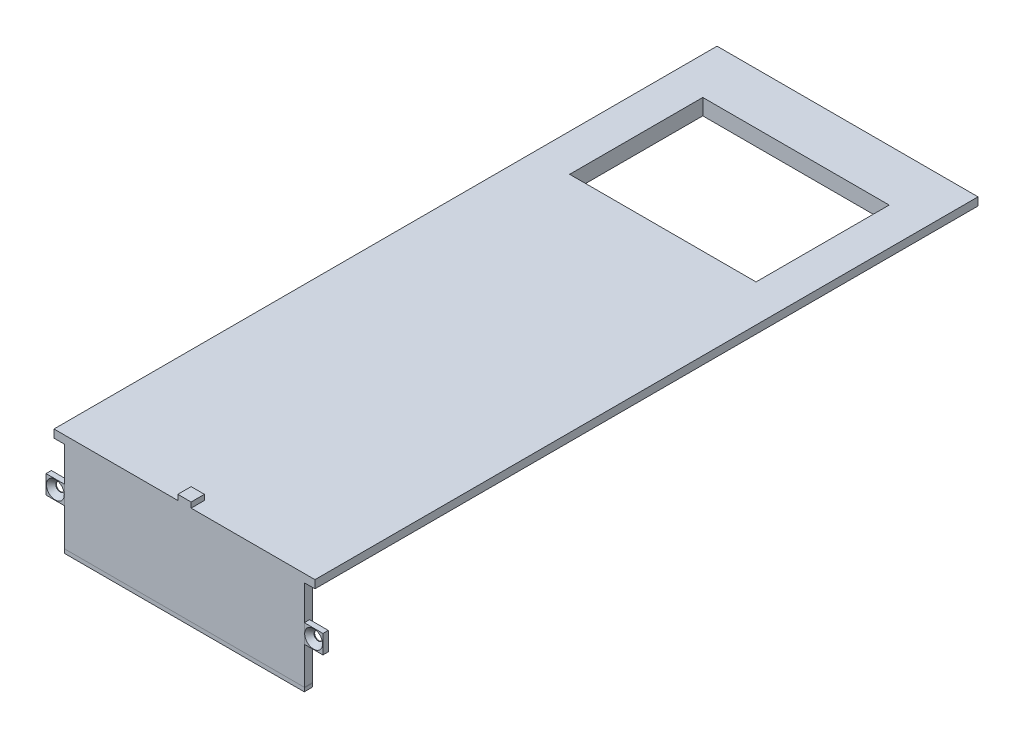
ISO-10303-21;
HEADER;
FILE_DESCRIPTION(('STEP AP214'),'2;1');
FILE_NAME('part.step','',(''),(''),'','','');
FILE_SCHEMA(('AUTOMOTIVE_DESIGN { 1 0 10303 214 1 1 1 1 }'));
ENDSEC;
DATA;
#1=APPLICATION_CONTEXT('core data for automotive mechanical design processes');
#2=APPLICATION_PROTOCOL_DEFINITION('international standard','automotive_design',2000,#1);
#3=PRODUCT_CONTEXT('',#1,'mechanical');
#4=PRODUCT('Part','Part','',(#3));
#5=PRODUCT_RELATED_PRODUCT_CATEGORY('part','',(#4));
#6=PRODUCT_DEFINITION_FORMATION('','',#4);
#7=PRODUCT_DEFINITION_CONTEXT('part definition',#1,'design');
#8=PRODUCT_DEFINITION('design','',#6,#7);
#9=PRODUCT_DEFINITION_SHAPE('','',#8);
#10=(LENGTH_UNIT() NAMED_UNIT(*) SI_UNIT(.MILLI.,.METRE.));
#11=(NAMED_UNIT(*) PLANE_ANGLE_UNIT() SI_UNIT($,.RADIAN.));
#12=(NAMED_UNIT(*) SI_UNIT($,.STERADIAN.) SOLID_ANGLE_UNIT());
#13=UNCERTAINTY_MEASURE_WITH_UNIT(LENGTH_MEASURE(1.E-05),#10,'distance_accuracy_value','');
#14=(GEOMETRIC_REPRESENTATION_CONTEXT(3) GLOBAL_UNCERTAINTY_ASSIGNED_CONTEXT((#13)) GLOBAL_UNIT_ASSIGNED_CONTEXT((#10,
#11,#12)) REPRESENTATION_CONTEXT('',''));
#15=CARTESIAN_POINT('',(0.,0.,0.));
#16=DIRECTION('',(0.,0.,1.));
#17=DIRECTION('',(1.,0.,0.));
#18=AXIS2_PLACEMENT_3D('',#15,#16,#17);
#19=CARTESIAN_POINT('',(45.,-37.,-3.));
#20=DIRECTION('',(0.,1.,0.));
#21=DIRECTION('',(-1.,0.,0.));
#22=AXIS2_PLACEMENT_3D('',#19,#20,#21);
#23=PLANE('',#22);
#24=DIRECTION('',(-1.,0.,0.));
#25=VECTOR('',#24,1.);
#26=CARTESIAN_POINT('',(45.,-37.,0.));
#27=LINE('',#26,#25);
#28=CARTESIAN_POINT('',(45.,-37.,0.));
#29=VERTEX_POINT('',#28);
#30=CARTESIAN_POINT('',(-45.,-37.,0.));
#31=VERTEX_POINT('',#30);
#32=EDGE_CURVE('E122',#29,#31,#27,.T.);
#33=ORIENTED_EDGE('',*,*,#32,.F.);
#34=DIRECTION('',(0.,0.,1.));
#35=VECTOR('',#34,1.);
#36=CARTESIAN_POINT('',(45.,-37.,-3.));
#37=LINE('',#36,#35);
#38=CARTESIAN_POINT('',(45.,-37.,-3.));
#39=VERTEX_POINT('',#38);
#40=EDGE_CURVE('E12',#39,#29,#37,.T.);
#41=ORIENTED_EDGE('',*,*,#40,.F.);
#42=DIRECTION('',(-1.,0.,0.));
#43=VECTOR('',#42,1.);
#44=CARTESIAN_POINT('',(45.,-37.,-3.));
#45=LINE('',#44,#43);
#46=CARTESIAN_POINT('',(-45.,-37.,-3.));
#47=VERTEX_POINT('',#46);
#48=EDGE_CURVE('E117',#39,#47,#45,.T.);
#49=ORIENTED_EDGE('',*,*,#48,.T.);
#50=DIRECTION('',(0.,0.,1.));
#51=VECTOR('',#50,1.);
#52=CARTESIAN_POINT('',(-45.,-37.,-3.));
#53=LINE('',#52,#51);
#54=EDGE_CURVE('E48',#47,#31,#53,.T.);
#55=ORIENTED_EDGE('',*,*,#54,.T.);
#56=EDGE_LOOP('',(#33,#41,#49,#55));
#57=FACE_BOUND('',#56,.T.);
#58=ADVANCED_FACE('F45',(#57),#23,.T.);
#59=CARTESIAN_POINT('',(45.,-37.,-3.));
#60=DIRECTION('',(0.998843980280576,-0.0480697728022189,0.));
#61=DIRECTION('',(0.0480697728022189,0.998843980280576,0.));
#62=AXIS2_PLACEMENT_3D('',#59,#60,#61);
#63=PLANE('',#62);
#64=DIRECTION('',(0.0480697728022189,0.998843980280576,0.));
#65=VECTOR('',#64,1.);
#66=CARTESIAN_POINT('',(45.,-37.,0.));
#67=LINE('',#66,#65);
#68=CARTESIAN_POINT('',(44.9879487550135,-37.2504133639074,0.));
#69=VERTEX_POINT('',#68);
#70=EDGE_CURVE('E131',#69,#29,#67,.T.);
#71=ORIENTED_EDGE('',*,*,#70,.F.);
#72=DIRECTION('',(0.,0.,1.));
#73=VECTOR('',#72,1.);
#74=CARTESIAN_POINT('',(44.9879487550135,-37.2504133639074,-3.));
#75=LINE('',#74,#73);
#76=CARTESIAN_POINT('',(44.9879487550135,-37.2504133639074,-3.));
#77=VERTEX_POINT('',#76);
#78=EDGE_CURVE('E54',#77,#69,#75,.T.);
#79=ORIENTED_EDGE('',*,*,#78,.F.);
#80=DIRECTION('',(0.0480697728022189,0.998843980280576,0.));
#81=VECTOR('',#80,1.);
#82=CARTESIAN_POINT('',(45.,-37.,-3.));
#83=LINE('',#82,#81);
#84=EDGE_CURVE('E112',#77,#39,#83,.T.);
#85=ORIENTED_EDGE('',*,*,#84,.T.);
#86=ORIENTED_EDGE('',*,*,#40,.T.);
#87=EDGE_LOOP('',(#71,#79,#85,#86));
#88=FACE_BOUND('',#87,.T.);
#89=ADVANCED_FACE('F137',(#88),#63,.T.);
#90=CARTESIAN_POINT('',(44.9879487550135,-38.5008682809479,-3.));
#91=DIRECTION('',(1.,0.,0.));
#92=DIRECTION('',(0.,0.,-1.));
#93=AXIS2_PLACEMENT_3D('',#90,#91,#92);
#94=PLANE('',#93);
#95=DIRECTION('',(0.,1.,0.));
#96=VECTOR('',#95,1.);
#97=CARTESIAN_POINT('',(44.9879487550135,-38.5008682809479,0.));
#98=LINE('',#97,#96);
#99=CARTESIAN_POINT('',(44.9879487550135,-38.5008682809479,0.));
#100=VERTEX_POINT('',#99);
#101=EDGE_CURVE('E101',#100,#69,#98,.T.);
#102=ORIENTED_EDGE('',*,*,#101,.F.);
#103=DIRECTION('',(0.,0.,1.));
#104=VECTOR('',#103,1.);
#105=CARTESIAN_POINT('',(44.9879487550135,-38.5008682809479,-3.));
#106=LINE('',#105,#104);
#107=CARTESIAN_POINT('',(44.9879487550135,-38.5008682809479,-3.));
#108=VERTEX_POINT('',#107);
#109=EDGE_CURVE('E96',#108,#100,#106,.T.);
#110=ORIENTED_EDGE('',*,*,#109,.F.);
#111=DIRECTION('',(0.,1.,0.));
#112=VECTOR('',#111,1.);
#113=CARTESIAN_POINT('',(44.9879487550135,-38.5008682809479,-3.));
#114=LINE('',#113,#112);
#115=EDGE_CURVE('E99',#108,#77,#114,.T.);
#116=ORIENTED_EDGE('',*,*,#115,.T.);
#117=ORIENTED_EDGE('',*,*,#78,.T.);
#118=EDGE_LOOP('',(#102,#110,#116,#117));
#119=FACE_BOUND('',#118,.T.);
#120=ADVANCED_FACE('F98',(#119),#94,.T.);
#121=CARTESIAN_POINT('',(-45.,-38.5008682809479,-3.));
#122=DIRECTION('',(0.,-1.,0.));
#123=DIRECTION('',(0.,0.,-1.));
#124=AXIS2_PLACEMENT_3D('',#121,#122,#123);
#125=PLANE('',#124);
#126=DIRECTION('',(1.,0.,0.));
#127=VECTOR('',#126,1.);
#128=CARTESIAN_POINT('',(-45.,-38.5008682809479,0.));
#129=LINE('',#128,#127);
#130=CARTESIAN_POINT('',(-45.,-38.5008682809479,0.));
#131=VERTEX_POINT('',#130);
#132=EDGE_CURVE('E128',#131,#100,#129,.T.);
#133=ORIENTED_EDGE('',*,*,#132,.F.);
#134=DIRECTION('',(0.,0.,1.));
#135=VECTOR('',#134,1.);
#136=CARTESIAN_POINT('',(-45.,-38.5008682809479,-3.));
#137=LINE('',#136,#135);
#138=CARTESIAN_POINT('',(-45.,-38.5008682809479,-3.));
#139=VERTEX_POINT('',#138);
#140=EDGE_CURVE('E106',#139,#131,#137,.T.);
#141=ORIENTED_EDGE('',*,*,#140,.F.);
#142=DIRECTION('',(1.,0.,0.));
#143=VECTOR('',#142,1.);
#144=CARTESIAN_POINT('',(-45.,-38.5008682809479,-3.));
#145=LINE('',#144,#143);
#146=EDGE_CURVE('E111',#139,#108,#145,.T.);
#147=ORIENTED_EDGE('',*,*,#146,.T.);
#148=ORIENTED_EDGE('',*,*,#109,.T.);
#149=EDGE_LOOP('',(#133,#141,#147,#148));
#150=FACE_BOUND('',#149,.T.);
#151=ADVANCED_FACE('F114',(#150),#125,.T.);
#152=CARTESIAN_POINT('',(-45.,-37.,-3.));
#153=DIRECTION('',(-1.,0.,0.));
#154=DIRECTION('',(0.,-1.,0.));
#155=AXIS2_PLACEMENT_3D('',#152,#153,#154);
#156=PLANE('',#155);
#157=DIRECTION('',(0.,-1.,0.));
#158=VECTOR('',#157,1.);
#159=CARTESIAN_POINT('',(-45.,-37.,0.));
#160=LINE('',#159,#158);
#161=EDGE_CURVE('E125',#31,#131,#160,.T.);
#162=ORIENTED_EDGE('',*,*,#161,.F.);
#163=ORIENTED_EDGE('',*,*,#54,.F.);
#164=DIRECTION('',(0.,-1.,0.));
#165=VECTOR('',#164,1.);
#166=CARTESIAN_POINT('',(-45.,-37.,-3.));
#167=LINE('',#166,#165);
#168=EDGE_CURVE('E115',#47,#139,#167,.T.);
#169=ORIENTED_EDGE('',*,*,#168,.T.);
#170=ORIENTED_EDGE('',*,*,#140,.T.);
#171=EDGE_LOOP('',(#162,#163,#169,#170));
#172=FACE_BOUND('',#171,.T.);
#173=ADVANCED_FACE('F134',(#172),#156,.T.);
#174=CARTESIAN_POINT('',(0.,0.,-3.));
#175=DIRECTION('',(0.,0.,1.));
#176=DIRECTION('',(1.,0.,0.));
#177=AXIS2_PLACEMENT_3D('',#174,#175,#176);
#178=PLANE('',#177);
#179=ORIENTED_EDGE('',*,*,#48,.F.);
#180=ORIENTED_EDGE('',*,*,#84,.F.);
#181=ORIENTED_EDGE('',*,*,#115,.F.);
#182=ORIENTED_EDGE('',*,*,#146,.F.);
#183=ORIENTED_EDGE('',*,*,#168,.F.);
#184=EDGE_LOOP('',(#179,#180,#181,#182,#183));
#185=FACE_BOUND('',#184,.T.);
#186=ADVANCED_FACE('F110',(#185),#178,.F.);
#187=CARTESIAN_POINT('',(0.,0.,0.));
#188=DIRECTION('',(0.,0.,1.));
#189=DIRECTION('',(1.,0.,0.));
#190=AXIS2_PLACEMENT_3D('',#187,#188,#189);
#191=PLANE('',#190);
#192=ORIENTED_EDGE('',*,*,#32,.T.);
#193=ORIENTED_EDGE('',*,*,#161,.T.);
#194=ORIENTED_EDGE('',*,*,#132,.T.);
#195=ORIENTED_EDGE('',*,*,#101,.T.);
#196=ORIENTED_EDGE('',*,*,#70,.T.);
#197=EDGE_LOOP('',(#192,#193,#194,#195,#196));
#198=FACE_BOUND('',#197,.T.);
#199=ADVANCED_FACE('F136',(#198),#191,.T.);
#200=CLOSED_SHELL('',(#58,#89,#120,#151,#173,#186,#199));
#201=MANIFOLD_SOLID_BREP('B2',#200);
#202=CARTESIAN_POINT('',(45.,-16.,-2.));
#203=DIRECTION('',(-1.,0.,0.));
#204=DIRECTION('',(0.,0.,1.));
#205=AXIS2_PLACEMENT_3D('',#202,#203,#204);
#206=PLANE('',#205);
#207=DIRECTION('',(0.,-1.,0.));
#208=VECTOR('',#207,1.);
#209=CARTESIAN_POINT('',(45.,-16.,0.));
#210=LINE('',#209,#208);
#211=CARTESIAN_POINT('',(45.,-16.,0.));
#212=VERTEX_POINT('',#211);
#213=CARTESIAN_POINT('',(45.,-23.,0.));
#214=VERTEX_POINT('',#213);
#215=EDGE_CURVE('E269',#212,#214,#210,.T.);
#216=ORIENTED_EDGE('',*,*,#215,.F.);
#217=DIRECTION('',(0.,0.,1.));
#218=VECTOR('',#217,1.);
#219=CARTESIAN_POINT('',(45.,-16.,-2.));
#220=LINE('',#219,#218);
#221=CARTESIAN_POINT('',(45.,-16.,-2.));
#222=VERTEX_POINT('',#221);
#223=EDGE_CURVE('E43',#222,#212,#220,.T.);
#224=ORIENTED_EDGE('',*,*,#223,.F.);
#225=DIRECTION('',(0.,-1.,0.));
#226=VECTOR('',#225,1.);
#227=CARTESIAN_POINT('',(45.,-16.,-2.));
#228=LINE('',#227,#226);
#229=CARTESIAN_POINT('',(45.,-23.,-2.));
#230=VERTEX_POINT('',#229);
#231=EDGE_CURVE('E262',#222,#230,#228,.T.);
#232=ORIENTED_EDGE('',*,*,#231,.T.);
#233=DIRECTION('',(0.,0.,1.));
#234=VECTOR('',#233,1.);
#235=CARTESIAN_POINT('',(45.,-23.,-2.));
#236=LINE('',#235,#234);
#237=EDGE_CURVE('E207',#230,#214,#236,.T.);
#238=ORIENTED_EDGE('',*,*,#237,.T.);
#239=EDGE_LOOP('',(#216,#224,#232,#238));
#240=FACE_BOUND('',#239,.T.);
#241=ADVANCED_FACE('F204',(#240),#206,.T.);
#242=CARTESIAN_POINT('',(45.,-16.,-2.));
#243=DIRECTION('',(0.,1.,0.));
#244=DIRECTION('',(0.,0.,1.));
#245=AXIS2_PLACEMENT_3D('',#242,#243,#244);
#246=PLANE('',#245);
#247=DIRECTION('',(-1.,0.,0.));
#248=VECTOR('',#247,1.);
#249=CARTESIAN_POINT('',(45.,-16.,0.));
#250=LINE('',#249,#248);
#251=CARTESIAN_POINT('',(52.,-16.,0.));
#252=VERTEX_POINT('',#251);
#253=EDGE_CURVE('E264',#252,#212,#250,.T.);
#254=ORIENTED_EDGE('',*,*,#253,.F.);
#255=DIRECTION('',(0.,0.,1.));
#256=VECTOR('',#255,1.);
#257=CARTESIAN_POINT('',(52.,-16.,-2.));
#258=LINE('',#257,#256);
#259=CARTESIAN_POINT('',(52.,-16.,-2.));
#260=VERTEX_POINT('',#259);
#261=EDGE_CURVE('E213',#260,#252,#258,.T.);
#262=ORIENTED_EDGE('',*,*,#261,.F.);
#263=DIRECTION('',(-1.,0.,0.));
#264=VECTOR('',#263,1.);
#265=CARTESIAN_POINT('',(45.,-16.,-2.));
#266=LINE('',#265,#264);
#267=EDGE_CURVE('E259',#260,#222,#266,.T.);
#268=ORIENTED_EDGE('',*,*,#267,.T.);
#269=ORIENTED_EDGE('',*,*,#223,.T.);
#270=EDGE_LOOP('',(#254,#262,#268,#269));
#271=FACE_BOUND('',#270,.T.);
#272=ADVANCED_FACE('F280',(#271),#246,.T.);
#273=CARTESIAN_POINT('',(52.,-16.,-2.));
#274=DIRECTION('',(1.,0.,0.));
#275=DIRECTION('',(0.,0.,-1.));
#276=AXIS2_PLACEMENT_3D('',#273,#274,#275);
#277=PLANE('',#276);
#278=DIRECTION('',(0.,1.,0.));
#279=VECTOR('',#278,1.);
#280=CARTESIAN_POINT('',(52.,-16.,0.));
#281=LINE('',#280,#279);
#282=CARTESIAN_POINT('',(52.,-23.,0.));
#283=VERTEX_POINT('',#282);
#284=EDGE_CURVE('E254',#283,#252,#281,.T.);
#285=ORIENTED_EDGE('',*,*,#284,.F.);
#286=DIRECTION('',(0.,0.,1.));
#287=VECTOR('',#286,1.);
#288=CARTESIAN_POINT('',(52.,-23.,-2.));
#289=LINE('',#288,#287);
#290=CARTESIAN_POINT('',(52.,-23.,-2.));
#291=VERTEX_POINT('',#290);
#292=EDGE_CURVE('E249',#291,#283,#289,.T.);
#293=ORIENTED_EDGE('',*,*,#292,.F.);
#294=DIRECTION('',(0.,1.,0.));
#295=VECTOR('',#294,1.);
#296=CARTESIAN_POINT('',(52.,-16.,-2.));
#297=LINE('',#296,#295);
#298=EDGE_CURVE('E252',#291,#260,#297,.T.);
#299=ORIENTED_EDGE('',*,*,#298,.T.);
#300=ORIENTED_EDGE('',*,*,#261,.T.);
#301=EDGE_LOOP('',(#285,#293,#299,#300));
#302=FACE_BOUND('',#301,.T.);
#303=ADVANCED_FACE('F251',(#302),#277,.T.);
#304=CARTESIAN_POINT('',(45.,-23.,-2.));
#305=DIRECTION('',(0.,-1.,0.));
#306=DIRECTION('',(0.,0.,-1.));
#307=AXIS2_PLACEMENT_3D('',#304,#305,#306);
#308=PLANE('',#307);
#309=DIRECTION('',(1.,0.,0.));
#310=VECTOR('',#309,1.);
#311=CARTESIAN_POINT('',(45.,-23.,0.));
#312=LINE('',#311,#310);
#313=EDGE_CURVE('E272',#214,#283,#312,.T.);
#314=ORIENTED_EDGE('',*,*,#313,.F.);
#315=ORIENTED_EDGE('',*,*,#237,.F.);
#316=DIRECTION('',(1.,0.,0.));
#317=VECTOR('',#316,1.);
#318=CARTESIAN_POINT('',(45.,-23.,-2.));
#319=LINE('',#318,#317);
#320=EDGE_CURVE('E258',#230,#291,#319,.T.);
#321=ORIENTED_EDGE('',*,*,#320,.T.);
#322=ORIENTED_EDGE('',*,*,#292,.T.);
#323=EDGE_LOOP('',(#314,#315,#321,#322));
#324=FACE_BOUND('',#323,.T.);
#325=ADVANCED_FACE('F261',(#324),#308,.T.);
#326=CARTESIAN_POINT('',(0.,0.,-2.));
#327=DIRECTION('',(0.,0.,1.));
#328=DIRECTION('',(1.,0.,0.));
#329=AXIS2_PLACEMENT_3D('',#326,#327,#328);
#330=PLANE('',#329);
#331=CARTESIAN_POINT('',(48.5,-19.5,-2.));
#332=DIRECTION('',(0.,0.,1.));
#333=DIRECTION('',(1.,0.,0.));
#334=AXIS2_PLACEMENT_3D('',#331,#332,#333);
#335=CIRCLE('',#334,1.6);
#336=CARTESIAN_POINT('',(50.1,-19.5,-2.));
#337=VERTEX_POINT('',#336);
#338=EDGE_CURVE('E273',#337,#337,#335,.T.);
#339=ORIENTED_EDGE('',*,*,#338,.T.);
#340=EDGE_LOOP('',(#339));
#341=FACE_BOUND('',#340,.T.);
#342=ORIENTED_EDGE('',*,*,#231,.F.);
#343=ORIENTED_EDGE('',*,*,#267,.F.);
#344=ORIENTED_EDGE('',*,*,#298,.F.);
#345=ORIENTED_EDGE('',*,*,#320,.F.);
#346=EDGE_LOOP('',(#342,#343,#344,#345));
#347=FACE_BOUND('',#346,.T.);
#348=ADVANCED_FACE('F257',(#341,#347),#330,.F.);
#349=CARTESIAN_POINT('',(0.,0.,0.));
#350=DIRECTION('',(0.,0.,1.));
#351=DIRECTION('',(1.,0.,0.));
#352=AXIS2_PLACEMENT_3D('',#349,#350,#351);
#353=PLANE('',#352);
#354=CARTESIAN_POINT('',(48.5,-19.5,0.));
#355=DIRECTION('',(0.,0.,1.));
#356=DIRECTION('',(1.,0.,0.));
#357=AXIS2_PLACEMENT_3D('',#354,#355,#356);
#358=CIRCLE('',#357,3.36);
#359=CARTESIAN_POINT('',(51.86,-19.5,0.));
#360=VERTEX_POINT('',#359);
#361=EDGE_CURVE('E316',#360,#360,#358,.T.);
#362=ORIENTED_EDGE('',*,*,#361,.F.);
#363=EDGE_LOOP('',(#362));
#364=FACE_BOUND('',#363,.T.);
#365=ORIENTED_EDGE('',*,*,#215,.T.);
#366=ORIENTED_EDGE('',*,*,#313,.T.);
#367=ORIENTED_EDGE('',*,*,#284,.T.);
#368=ORIENTED_EDGE('',*,*,#253,.T.);
#369=EDGE_LOOP('',(#365,#366,#367,#368));
#370=FACE_BOUND('',#369,.T.);
#371=ADVANCED_FACE('F279',(#364,#370),#353,.T.);
#372=CARTESIAN_POINT('',(48.5,-19.5,-2.));
#373=DIRECTION('',(0.,0.,1.));
#374=DIRECTION('',(1.,0.,0.));
#375=AXIS2_PLACEMENT_3D('',#372,#373,#374);
#376=CYLINDRICAL_SURFACE('',#375,1.6);
#377=CARTESIAN_POINT('',(48.5,-19.5,-1.76));
#378=DIRECTION('',(0.,0.,1.));
#379=DIRECTION('',(1.,0.,0.));
#380=AXIS2_PLACEMENT_3D('',#377,#378,#379);
#381=CIRCLE('',#380,1.6);
#382=CARTESIAN_POINT('',(50.1,-19.5,-1.76));
#383=VERTEX_POINT('',#382);
#384=EDGE_CURVE('E313',#383,#383,#381,.T.);
#385=ORIENTED_EDGE('',*,*,#384,.T.);
#386=EDGE_LOOP('',(#385));
#387=FACE_BOUND('',#386,.T.);
#388=ORIENTED_EDGE('',*,*,#338,.F.);
#389=EDGE_LOOP('',(#388));
#390=FACE_BOUND('',#389,.T.);
#391=ADVANCED_FACE('F298',(#387,#390),#376,.F.);
#392=CARTESIAN_POINT('',(48.5,-19.5,0.));
#393=DIRECTION('',(0.,0.,1.));
#394=DIRECTION('',(1.,0.,0.));
#395=AXIS2_PLACEMENT_3D('',#392,#393,#394);
#396=CONICAL_SURFACE('',#395,3.36,0.78539816339745);
#397=ORIENTED_EDGE('',*,*,#384,.F.);
#398=EDGE_LOOP('',(#397));
#399=FACE_BOUND('',#398,.T.);
#400=ORIENTED_EDGE('',*,*,#361,.T.);
#401=EDGE_LOOP('',(#400));
#402=FACE_BOUND('',#401,.T.);
#403=ADVANCED_FACE('F304',(#399,#402),#396,.F.);
#404=CLOSED_SHELL('',(#241,#272,#303,#325,#348,#371,#391,#403));
#405=MANIFOLD_SOLID_BREP('B6',#404);
#406=CARTESIAN_POINT('',(-45.,-16.,-2.));
#407=DIRECTION('',(1.,0.,0.));
#408=DIRECTION('',(0.,0.,-1.));
#409=AXIS2_PLACEMENT_3D('',#406,#407,#408);
#410=PLANE('',#409);
#411=DIRECTION('',(0.,1.,0.));
#412=VECTOR('',#411,1.);
#413=CARTESIAN_POINT('',(-45.,-16.,0.));
#414=LINE('',#413,#412);
#415=CARTESIAN_POINT('',(-45.,-23.,0.));
#416=VERTEX_POINT('',#415);
#417=CARTESIAN_POINT('',(-45.,-16.,0.));
#418=VERTEX_POINT('',#417);
#419=EDGE_CURVE('E437',#416,#418,#414,.T.);
#420=ORIENTED_EDGE('',*,*,#419,.F.);
#421=DIRECTION('',(0.,0.,1.));
#422=VECTOR('',#421,1.);
#423=CARTESIAN_POINT('',(-45.,-23.,-2.));
#424=LINE('',#423,#422);
#425=CARTESIAN_POINT('',(-45.,-23.,-2.));
#426=VERTEX_POINT('',#425);
#427=EDGE_CURVE('E202',#426,#416,#424,.T.);
#428=ORIENTED_EDGE('',*,*,#427,.F.);
#429=DIRECTION('',(0.,1.,0.));
#430=VECTOR('',#429,1.);
#431=CARTESIAN_POINT('',(-45.,-16.,-2.));
#432=LINE('',#431,#430);
#433=CARTESIAN_POINT('',(-45.,-16.,-2.));
#434=VERTEX_POINT('',#433);
#435=EDGE_CURVE('E430',#426,#434,#432,.T.);
#436=ORIENTED_EDGE('',*,*,#435,.T.);
#437=DIRECTION('',(0.,0.,1.));
#438=VECTOR('',#437,1.);
#439=CARTESIAN_POINT('',(-45.,-16.,-2.));
#440=LINE('',#439,#438);
#441=EDGE_CURVE('E375',#434,#418,#440,.T.);
#442=ORIENTED_EDGE('',*,*,#441,.T.);
#443=EDGE_LOOP('',(#420,#428,#436,#442));
#444=FACE_BOUND('',#443,.T.);
#445=ADVANCED_FACE('F372',(#444),#410,.T.);
#446=CARTESIAN_POINT('',(-45.,-23.,-2.));
#447=DIRECTION('',(0.,-1.,0.));
#448=DIRECTION('',(0.,0.,-1.));
#449=AXIS2_PLACEMENT_3D('',#446,#447,#448);
#450=PLANE('',#449);
#451=DIRECTION('',(1.,0.,0.));
#452=VECTOR('',#451,1.);
#453=CARTESIAN_POINT('',(-45.,-23.,0.));
#454=LINE('',#453,#452);
#455=CARTESIAN_POINT('',(-52.,-23.,0.));
#456=VERTEX_POINT('',#455);
#457=EDGE_CURVE('E432',#456,#416,#454,.T.);
#458=ORIENTED_EDGE('',*,*,#457,.F.);
#459=DIRECTION('',(0.,0.,1.));
#460=VECTOR('',#459,1.);
#461=CARTESIAN_POINT('',(-52.,-23.,-2.));
#462=LINE('',#461,#460);
#463=CARTESIAN_POINT('',(-52.,-23.,-2.));
#464=VERTEX_POINT('',#463);
#465=EDGE_CURVE('E381',#464,#456,#462,.T.);
#466=ORIENTED_EDGE('',*,*,#465,.F.);
#467=DIRECTION('',(1.,0.,0.));
#468=VECTOR('',#467,1.);
#469=CARTESIAN_POINT('',(-45.,-23.,-2.));
#470=LINE('',#469,#468);
#471=EDGE_CURVE('E427',#464,#426,#470,.T.);
#472=ORIENTED_EDGE('',*,*,#471,.T.);
#473=ORIENTED_EDGE('',*,*,#427,.T.);
#474=EDGE_LOOP('',(#458,#466,#472,#473));
#475=FACE_BOUND('',#474,.T.);
#476=ADVANCED_FACE('F448',(#475),#450,.T.);
#477=CARTESIAN_POINT('',(-52.,-16.,-2.));
#478=DIRECTION('',(-1.,0.,0.));
#479=DIRECTION('',(0.,0.,1.));
#480=AXIS2_PLACEMENT_3D('',#477,#478,#479);
#481=PLANE('',#480);
#482=DIRECTION('',(0.,-1.,0.));
#483=VECTOR('',#482,1.);
#484=CARTESIAN_POINT('',(-52.,-16.,0.));
#485=LINE('',#484,#483);
#486=CARTESIAN_POINT('',(-52.,-16.,0.));
#487=VERTEX_POINT('',#486);
#488=EDGE_CURVE('E422',#487,#456,#485,.T.);
#489=ORIENTED_EDGE('',*,*,#488,.F.);
#490=DIRECTION('',(0.,0.,1.));
#491=VECTOR('',#490,1.);
#492=CARTESIAN_POINT('',(-52.,-16.,-2.));
#493=LINE('',#492,#491);
#494=CARTESIAN_POINT('',(-52.,-16.,-2.));
#495=VERTEX_POINT('',#494);
#496=EDGE_CURVE('E417',#495,#487,#493,.T.);
#497=ORIENTED_EDGE('',*,*,#496,.F.);
#498=DIRECTION('',(0.,-1.,0.));
#499=VECTOR('',#498,1.);
#500=CARTESIAN_POINT('',(-52.,-16.,-2.));
#501=LINE('',#500,#499);
#502=EDGE_CURVE('E420',#495,#464,#501,.T.);
#503=ORIENTED_EDGE('',*,*,#502,.T.);
#504=ORIENTED_EDGE('',*,*,#465,.T.);
#505=EDGE_LOOP('',(#489,#497,#503,#504));
#506=FACE_BOUND('',#505,.T.);
#507=ADVANCED_FACE('F419',(#506),#481,.T.);
#508=CARTESIAN_POINT('',(-45.,-16.,-2.));
#509=DIRECTION('',(0.,1.,0.));
#510=DIRECTION('',(0.,0.,1.));
#511=AXIS2_PLACEMENT_3D('',#508,#509,#510);
#512=PLANE('',#511);
#513=DIRECTION('',(-1.,0.,0.));
#514=VECTOR('',#513,1.);
#515=CARTESIAN_POINT('',(-45.,-16.,0.));
#516=LINE('',#515,#514);
#517=EDGE_CURVE('E440',#418,#487,#516,.T.);
#518=ORIENTED_EDGE('',*,*,#517,.F.);
#519=ORIENTED_EDGE('',*,*,#441,.F.);
#520=DIRECTION('',(-1.,0.,0.));
#521=VECTOR('',#520,1.);
#522=CARTESIAN_POINT('',(-45.,-16.,-2.));
#523=LINE('',#522,#521);
#524=EDGE_CURVE('E426',#434,#495,#523,.T.);
#525=ORIENTED_EDGE('',*,*,#524,.T.);
#526=ORIENTED_EDGE('',*,*,#496,.T.);
#527=EDGE_LOOP('',(#518,#519,#525,#526));
#528=FACE_BOUND('',#527,.T.);
#529=ADVANCED_FACE('F429',(#528),#512,.T.);
#530=CARTESIAN_POINT('',(0.,0.,-2.));
#531=DIRECTION('',(0.,0.,-1.));
#532=DIRECTION('',(-1.,0.,0.));
#533=AXIS2_PLACEMENT_3D('',#530,#531,#532);
#534=PLANE('',#533);
#535=CARTESIAN_POINT('',(-48.5,-19.5,-2.));
#536=DIRECTION('',(0.,0.,1.));
#537=DIRECTION('',(1.,0.,0.));
#538=AXIS2_PLACEMENT_3D('',#535,#536,#537);
#539=CIRCLE('',#538,1.59999999999999);
#540=CARTESIAN_POINT('',(-46.9,-19.5,-2.));
#541=VERTEX_POINT('',#540);
#542=EDGE_CURVE('E441',#541,#541,#539,.T.);
#543=ORIENTED_EDGE('',*,*,#542,.T.);
#544=EDGE_LOOP('',(#543));
#545=FACE_BOUND('',#544,.T.);
#546=ORIENTED_EDGE('',*,*,#435,.F.);
#547=ORIENTED_EDGE('',*,*,#471,.F.);
#548=ORIENTED_EDGE('',*,*,#502,.F.);
#549=ORIENTED_EDGE('',*,*,#524,.F.);
#550=EDGE_LOOP('',(#546,#547,#548,#549));
#551=FACE_BOUND('',#550,.T.);
#552=ADVANCED_FACE('F425',(#545,#551),#534,.T.);
#553=CARTESIAN_POINT('',(0.,0.,0.));
#554=DIRECTION('',(0.,0.,-1.));
#555=DIRECTION('',(-1.,0.,0.));
#556=AXIS2_PLACEMENT_3D('',#553,#554,#555);
#557=PLANE('',#556);
#558=CARTESIAN_POINT('',(-48.5,-19.5,0.));
#559=DIRECTION('',(0.,0.,1.));
#560=DIRECTION('',(1.,0.,0.));
#561=AXIS2_PLACEMENT_3D('',#558,#559,#560);
#562=CIRCLE('',#561,3.36);
#563=CARTESIAN_POINT('',(-45.14,-19.5,0.));
#564=VERTEX_POINT('',#563);
#565=EDGE_CURVE('E484',#564,#564,#562,.T.);
#566=ORIENTED_EDGE('',*,*,#565,.F.);
#567=EDGE_LOOP('',(#566));
#568=FACE_BOUND('',#567,.T.);
#569=ORIENTED_EDGE('',*,*,#419,.T.);
#570=ORIENTED_EDGE('',*,*,#517,.T.);
#571=ORIENTED_EDGE('',*,*,#488,.T.);
#572=ORIENTED_EDGE('',*,*,#457,.T.);
#573=EDGE_LOOP('',(#569,#570,#571,#572));
#574=FACE_BOUND('',#573,.T.);
#575=ADVANCED_FACE('F447',(#568,#574),#557,.F.);
#576=CARTESIAN_POINT('',(-48.5,-19.5,-2.));
#577=DIRECTION('',(0.,0.,1.));
#578=DIRECTION('',(1.,0.,0.));
#579=AXIS2_PLACEMENT_3D('',#576,#577,#578);
#580=CYLINDRICAL_SURFACE('',#579,1.59999999999999);
#581=CARTESIAN_POINT('',(-48.5,-19.5,-1.76));
#582=DIRECTION('',(0.,0.,1.));
#583=DIRECTION('',(1.,0.,0.));
#584=AXIS2_PLACEMENT_3D('',#581,#582,#583);
#585=CIRCLE('',#584,1.6);
#586=CARTESIAN_POINT('',(-46.9,-19.5,-1.76));
#587=VERTEX_POINT('',#586);
#588=EDGE_CURVE('E481',#587,#587,#585,.T.);
#589=ORIENTED_EDGE('',*,*,#588,.T.);
#590=EDGE_LOOP('',(#589));
#591=FACE_BOUND('',#590,.T.);
#592=ORIENTED_EDGE('',*,*,#542,.F.);
#593=EDGE_LOOP('',(#592));
#594=FACE_BOUND('',#593,.T.);
#595=ADVANCED_FACE('F466',(#591,#594),#580,.F.);
#596=CARTESIAN_POINT('',(-48.5,-19.5,0.));
#597=DIRECTION('',(0.,0.,1.));
#598=DIRECTION('',(1.,0.,0.));
#599=AXIS2_PLACEMENT_3D('',#596,#597,#598);
#600=CONICAL_SURFACE('',#599,3.36,0.78539816339745);
#601=ORIENTED_EDGE('',*,*,#588,.F.);
#602=EDGE_LOOP('',(#601));
#603=FACE_BOUND('',#602,.T.);
#604=ORIENTED_EDGE('',*,*,#565,.T.);
#605=EDGE_LOOP('',(#604));
#606=FACE_BOUND('',#605,.T.);
#607=ADVANCED_FACE('F472',(#603,#606),#600,.F.);
#608=CLOSED_SHELL('',(#445,#476,#507,#529,#552,#575,#595,#607));
#609=MANIFOLD_SOLID_BREP('B37',#608);
#610=CARTESIAN_POINT('',(-50.,0.,-249.));
#611=DIRECTION('',(0.,-1.,0.));
#612=DIRECTION('',(1.,0.,0.));
#613=AXIS2_PLACEMENT_3D('',#610,#611,#612);
#614=PLANE('',#613);
#615=DIRECTION('',(1.,0.,0.));
#616=VECTOR('',#615,1.);
#617=CARTESIAN_POINT('',(-35.,0.,-179.64545313802));
#618=LINE('',#617,#616);
#619=CARTESIAN_POINT('',(-35.,0.,-179.64545313802));
#620=VERTEX_POINT('',#619);
#621=CARTESIAN_POINT('',(35.,0.,-179.64545313802));
#622=VERTEX_POINT('',#621);
#623=EDGE_CURVE('E738',#620,#622,#618,.T.);
#624=ORIENTED_EDGE('',*,*,#623,.F.);
#625=DIRECTION('',(0.,0.,1.));
#626=VECTOR('',#625,1.);
#627=CARTESIAN_POINT('',(-35.,0.,-229.64545313802));
#628=LINE('',#627,#626);
#629=CARTESIAN_POINT('',(-35.,0.,-229.64545313802));
#630=VERTEX_POINT('',#629);
#631=EDGE_CURVE('E736',#630,#620,#628,.T.);
#632=ORIENTED_EDGE('',*,*,#631,.F.);
#633=DIRECTION('',(-1.,0.,0.));
#634=VECTOR('',#633,1.);
#635=CARTESIAN_POINT('',(-35.,0.,-229.64545313802));
#636=LINE('',#635,#634);
#637=CARTESIAN_POINT('',(35.,0.,-229.64545313802));
#638=VERTEX_POINT('',#637);
#639=EDGE_CURVE('E744',#638,#630,#636,.T.);
#640=ORIENTED_EDGE('',*,*,#639,.F.);
#641=DIRECTION('',(0.,0.,-1.));
#642=VECTOR('',#641,1.);
#643=CARTESIAN_POINT('',(35.,0.,-229.64545313802));
#644=LINE('',#643,#642);
#645=EDGE_CURVE('E741',#622,#638,#644,.T.);
#646=ORIENTED_EDGE('',*,*,#645,.F.);
#647=EDGE_LOOP('',(#624,#632,#640,#646));
#648=FACE_BOUND('',#647,.T.);
#649=DIRECTION('',(1.,0.,0.));
#650=VECTOR('',#649,1.);
#651=CARTESIAN_POINT('',(-50.,0.,-249.));
#652=LINE('',#651,#650);
#653=CARTESIAN_POINT('',(-49.,0.,-249.));
#654=VERTEX_POINT('',#653);
#655=CARTESIAN_POINT('',(49.,0.,-249.));
#656=VERTEX_POINT('',#655);
#657=EDGE_CURVE('E666',#654,#656,#652,.T.);
#658=ORIENTED_EDGE('',*,*,#657,.F.);
#659=DIRECTION('',(0.,0.,1.));
#660=VECTOR('',#659,1.);
#661=CARTESIAN_POINT('',(-49.,0.,-249.));
#662=LINE('',#661,#660);
#663=CARTESIAN_POINT('',(-49.,0.,0.));
#664=VERTEX_POINT('',#663);
#665=EDGE_CURVE('E689',#654,#664,#662,.T.);
#666=ORIENTED_EDGE('',*,*,#665,.T.);
#667=DIRECTION('',(1.,0.,0.));
#668=VECTOR('',#667,1.);
#669=CARTESIAN_POINT('',(-50.,0.,0.));
#670=LINE('',#669,#668);
#671=CARTESIAN_POINT('',(-2.5,0.,0.));
#672=VERTEX_POINT('',#671);
#673=EDGE_CURVE('E791',#664,#672,#670,.T.);
#674=ORIENTED_EDGE('',*,*,#673,.T.);
#675=DIRECTION('',(0.,0.,1.));
#676=VECTOR('',#675,1.);
#677=CARTESIAN_POINT('',(-2.5,0.,0.));
#678=LINE('',#677,#676);
#679=CARTESIAN_POINT('',(-2.5,0.,-5.));
#680=VERTEX_POINT('',#679);
#681=EDGE_CURVE('E554',#680,#672,#678,.T.);
#682=ORIENTED_EDGE('',*,*,#681,.F.);
#683=DIRECTION('',(-1.,0.,0.));
#684=VECTOR('',#683,1.);
#685=CARTESIAN_POINT('',(-2.5,0.,-5.));
#686=LINE('',#685,#684);
#687=CARTESIAN_POINT('',(2.5,0.,-5.));
#688=VERTEX_POINT('',#687);
#689=EDGE_CURVE('E713',#688,#680,#686,.T.);
#690=ORIENTED_EDGE('',*,*,#689,.F.);
#691=DIRECTION('',(0.,0.,-1.));
#692=VECTOR('',#691,1.);
#693=CARTESIAN_POINT('',(2.5,0.,0.));
#694=LINE('',#693,#692);
#695=CARTESIAN_POINT('',(2.5,0.,0.));
#696=VERTEX_POINT('',#695);
#697=EDGE_CURVE('E721',#696,#688,#694,.T.);
#698=ORIENTED_EDGE('',*,*,#697,.F.);
#699=CARTESIAN_POINT('',(49.,0.,0.));
#700=VERTEX_POINT('',#699);
#701=EDGE_CURVE('E797',#696,#700,#670,.T.);
#702=ORIENTED_EDGE('',*,*,#701,.T.);
#703=DIRECTION('',(0.,0.,1.));
#704=VECTOR('',#703,1.);
#705=CARTESIAN_POINT('',(49.,0.,-249.));
#706=LINE('',#705,#704);
#707=EDGE_CURVE('E687',#656,#700,#706,.T.);
#708=ORIENTED_EDGE('',*,*,#707,.F.);
#709=EDGE_LOOP('',(#658,#666,#674,#682,#690,#698,#702,#708));
#710=FACE_BOUND('',#709,.T.);
#711=ADVANCED_FACE('F531',(#648,#710),#614,.F.);
#712=CARTESIAN_POINT('',(45.,-6.,-249.));
#713=DIRECTION('',(0.,1.,0.));
#714=DIRECTION('',(-1.,0.,0.));
#715=AXIS2_PLACEMENT_3D('',#712,#713,#714);
#716=PLANE('',#715);
#717=DIRECTION('',(-1.,0.,0.));
#718=VECTOR('',#717,1.);
#719=CARTESIAN_POINT('',(45.,-6.,-229.64545313802));
#720=LINE('',#719,#718);
#721=CARTESIAN_POINT('',(35.,-6.,-229.64545313802));
#722=VERTEX_POINT('',#721);
#723=CARTESIAN_POINT('',(-35.,-6.00000000000001,-229.64545313802));
#724=VERTEX_POINT('',#723);
#725=EDGE_CURVE('E762',#722,#724,#720,.T.);
#726=ORIENTED_EDGE('',*,*,#725,.T.);
#727=DIRECTION('',(0.,0.,1.));
#728=VECTOR('',#727,1.);
#729=CARTESIAN_POINT('',(-35.,-6.00000000000001,-249.));
#730=LINE('',#729,#728);
#731=CARTESIAN_POINT('',(-35.,-6.00000000000001,-179.64545313802));
#732=VERTEX_POINT('',#731);
#733=EDGE_CURVE('E765',#724,#732,#730,.T.);
#734=ORIENTED_EDGE('',*,*,#733,.T.);
#735=DIRECTION('',(1.,0.,0.));
#736=VECTOR('',#735,1.);
#737=CARTESIAN_POINT('',(45.,-6.,-179.64545313802));
#738=LINE('',#737,#736);
#739=CARTESIAN_POINT('',(35.,-6.,-179.64545313802));
#740=VERTEX_POINT('',#739);
#741=EDGE_CURVE('E750',#732,#740,#738,.T.);
#742=ORIENTED_EDGE('',*,*,#741,.T.);
#743=DIRECTION('',(0.,0.,-1.));
#744=VECTOR('',#743,1.);
#745=CARTESIAN_POINT('',(35.,-6.,-249.));
#746=LINE('',#745,#744);
#747=EDGE_CURVE('E759',#740,#722,#746,.T.);
#748=ORIENTED_EDGE('',*,*,#747,.T.);
#749=EDGE_LOOP('',(#726,#734,#742,#748));
#750=FACE_BOUND('',#749,.T.);
#751=DIRECTION('',(1.,0.,0.));
#752=VECTOR('',#751,1.);
#753=CARTESIAN_POINT('',(-45.,-6.00000000000001,-3.));
#754=LINE('',#753,#752);
#755=CARTESIAN_POINT('',(-45.,-6.00000000000001,-3.));
#756=VERTEX_POINT('',#755);
#757=CARTESIAN_POINT('',(45.,-6.,-3.));
#758=VERTEX_POINT('',#757);
#759=EDGE_CURVE('E768',#756,#758,#754,.T.);
#760=ORIENTED_EDGE('',*,*,#759,.F.);
#761=DIRECTION('',(0.,0.,1.));
#762=VECTOR('',#761,1.);
#763=CARTESIAN_POINT('',(-45.,-6.00000000000001,-249.));
#764=LINE('',#763,#762);
#765=CARTESIAN_POINT('',(-45.,-6.00000000000001,-249.));
#766=VERTEX_POINT('',#765);
#767=EDGE_CURVE('E539',#766,#756,#764,.T.);
#768=ORIENTED_EDGE('',*,*,#767,.F.);
#769=DIRECTION('',(-1.,0.,0.));
#770=VECTOR('',#769,1.);
#771=CARTESIAN_POINT('',(45.,-6.,-249.));
#772=LINE('',#771,#770);
#773=CARTESIAN_POINT('',(45.,-6.,-249.));
#774=VERTEX_POINT('',#773);
#775=EDGE_CURVE('E662',#774,#766,#772,.T.);
#776=ORIENTED_EDGE('',*,*,#775,.F.);
#777=DIRECTION('',(0.,0.,1.));
#778=VECTOR('',#777,1.);
#779=CARTESIAN_POINT('',(45.,-6.,-249.));
#780=LINE('',#779,#778);
#781=EDGE_CURVE('E370',#774,#758,#780,.T.);
#782=ORIENTED_EDGE('',*,*,#781,.T.);
#783=EDGE_LOOP('',(#760,#768,#776,#782));
#784=FACE_BOUND('',#783,.T.);
#785=ADVANCED_FACE('F824',(#750,#784),#716,.F.);
#786=CARTESIAN_POINT('',(45.,-4.,-249.));
#787=DIRECTION('',(-1.,0.,0.));
#788=DIRECTION('',(0.,0.,1.));
#789=AXIS2_PLACEMENT_3D('',#786,#787,#788);
#790=PLANE('',#789);
#791=DIRECTION('',(0.,-1.,0.));
#792=VECTOR('',#791,1.);
#793=CARTESIAN_POINT('',(45.,-4.,0.));
#794=LINE('',#793,#792);
#795=CARTESIAN_POINT('',(45.,-3.,0.));
#796=VERTEX_POINT('',#795);
#797=CARTESIAN_POINT('',(45.,-37.,0.));
#798=VERTEX_POINT('',#797);
#799=EDGE_CURVE('E788',#796,#798,#794,.T.);
#800=ORIENTED_EDGE('',*,*,#799,.T.);
#801=DIRECTION('',(0.,0.,1.));
#802=VECTOR('',#801,1.);
#803=CARTESIAN_POINT('',(45.,-37.,0.));
#804=LINE('',#803,#802);
#805=CARTESIAN_POINT('',(45.,-37.,-3.));
#806=VERTEX_POINT('',#805);
#807=EDGE_CURVE('E774',#806,#798,#804,.T.);
#808=ORIENTED_EDGE('',*,*,#807,.F.);
#809=DIRECTION('',(0.,1.,0.));
#810=VECTOR('',#809,1.);
#811=CARTESIAN_POINT('',(45.,-37.,-3.));
#812=LINE('',#811,#810);
#813=EDGE_CURVE('E780',#806,#758,#812,.T.);
#814=ORIENTED_EDGE('',*,*,#813,.T.);
#815=ORIENTED_EDGE('',*,*,#781,.F.);
#816=DIRECTION('',(0.,-1.,0.));
#817=VECTOR('',#816,1.);
#818=CARTESIAN_POINT('',(45.,-4.,-249.));
#819=LINE('',#818,#817);
#820=CARTESIAN_POINT('',(45.,-3.,-249.));
#821=VERTEX_POINT('',#820);
#822=EDGE_CURVE('E789',#821,#774,#819,.T.);
#823=ORIENTED_EDGE('',*,*,#822,.F.);
#824=DIRECTION('',(0.,0.,1.));
#825=VECTOR('',#824,1.);
#826=CARTESIAN_POINT('',(45.,-3.,-249.));
#827=LINE('',#826,#825);
#828=EDGE_CURVE('E705',#821,#796,#827,.T.);
#829=ORIENTED_EDGE('',*,*,#828,.T.);
#830=EDGE_LOOP('',(#800,#808,#814,#815,#823,#829));
#831=FACE_BOUND('',#830,.T.);
#832=ADVANCED_FACE('F533',(#831),#790,.F.);
#833=CARTESIAN_POINT('',(-45.,-6.00000000000001,-249.));
#834=DIRECTION('',(1.,0.,0.));
#835=DIRECTION('',(0.,1.,0.));
#836=AXIS2_PLACEMENT_3D('',#833,#834,#835);
#837=PLANE('',#836);
#838=DIRECTION('',(0.,1.,0.));
#839=VECTOR('',#838,1.);
#840=CARTESIAN_POINT('',(-45.,-6.00000000000001,0.));
#841=LINE('',#840,#839);
#842=CARTESIAN_POINT('',(-45.,-37.,0.));
#843=VERTEX_POINT('',#842);
#844=CARTESIAN_POINT('',(-45.,-3.00000000000002,0.));
#845=VERTEX_POINT('',#844);
#846=EDGE_CURVE('E672',#843,#845,#841,.T.);
#847=ORIENTED_EDGE('',*,*,#846,.T.);
#848=DIRECTION('',(0.,0.,1.));
#849=VECTOR('',#848,1.);
#850=CARTESIAN_POINT('',(-45.,-3.00000000000002,-249.));
#851=LINE('',#850,#849);
#852=CARTESIAN_POINT('',(-45.,-3.00000000000002,-249.));
#853=VERTEX_POINT('',#852);
#854=EDGE_CURVE('E669',#853,#845,#851,.T.);
#855=ORIENTED_EDGE('',*,*,#854,.F.);
#856=DIRECTION('',(0.,1.,0.));
#857=VECTOR('',#856,1.);
#858=CARTESIAN_POINT('',(-45.,-6.00000000000001,-249.));
#859=LINE('',#858,#857);
#860=EDGE_CURVE('E655',#766,#853,#859,.T.);
#861=ORIENTED_EDGE('',*,*,#860,.F.);
#862=ORIENTED_EDGE('',*,*,#767,.T.);
#863=DIRECTION('',(0.,1.,0.));
#864=VECTOR('',#863,1.);
#865=CARTESIAN_POINT('',(-45.,-37.,-3.));
#866=LINE('',#865,#864);
#867=CARTESIAN_POINT('',(-45.,-37.,-3.));
#868=VERTEX_POINT('',#867);
#869=EDGE_CURVE('E785',#868,#756,#866,.T.);
#870=ORIENTED_EDGE('',*,*,#869,.F.);
#871=DIRECTION('',(0.,0.,-1.));
#872=VECTOR('',#871,1.);
#873=CARTESIAN_POINT('',(-45.,-37.,0.));
#874=LINE('',#873,#872);
#875=EDGE_CURVE('E769',#843,#868,#874,.T.);
#876=ORIENTED_EDGE('',*,*,#875,.F.);
#877=EDGE_LOOP('',(#847,#855,#861,#862,#870,#876));
#878=FACE_BOUND('',#877,.T.);
#879=ADVANCED_FACE('F670',(#878),#837,.F.);
#880=CARTESIAN_POINT('',(0.,0.,-249.));
#881=DIRECTION('',(0.,0.,-1.));
#882=DIRECTION('',(-1.,0.,0.));
#883=AXIS2_PLACEMENT_3D('',#880,#881,#882);
#884=PLANE('',#883);
#885=DIRECTION('',(0.,1.,0.));
#886=VECTOR('',#885,1.);
#887=CARTESIAN_POINT('',(-49.,0.,-249.));
#888=LINE('',#887,#886);
#889=CARTESIAN_POINT('',(-49.,-3.00000000000002,-249.));
#890=VERTEX_POINT('',#889);
#891=EDGE_CURVE('E677',#890,#654,#888,.T.);
#892=ORIENTED_EDGE('',*,*,#891,.T.);
#893=ORIENTED_EDGE('',*,*,#657,.T.);
#894=DIRECTION('',(0.,-1.,0.));
#895=VECTOR('',#894,1.);
#896=CARTESIAN_POINT('',(49.,-3.,-249.));
#897=LINE('',#896,#895);
#898=CARTESIAN_POINT('',(49.,-3.,-249.));
#899=VERTEX_POINT('',#898);
#900=EDGE_CURVE('E693',#656,#899,#897,.T.);
#901=ORIENTED_EDGE('',*,*,#900,.T.);
#902=DIRECTION('',(-1.,0.,0.));
#903=VECTOR('',#902,1.);
#904=CARTESIAN_POINT('',(45.,-3.,-249.));
#905=LINE('',#904,#903);
#906=EDGE_CURVE('E696',#899,#821,#905,.T.);
#907=ORIENTED_EDGE('',*,*,#906,.T.);
#908=ORIENTED_EDGE('',*,*,#822,.T.);
#909=ORIENTED_EDGE('',*,*,#775,.T.);
#910=ORIENTED_EDGE('',*,*,#860,.T.);
#911=DIRECTION('',(-1.,0.,0.));
#912=VECTOR('',#911,1.);
#913=CARTESIAN_POINT('',(-49.,-3.00000000000002,-249.));
#914=LINE('',#913,#912);
#915=EDGE_CURVE('E660',#853,#890,#914,.T.);
#916=ORIENTED_EDGE('',*,*,#915,.T.);
#917=EDGE_LOOP('',(#892,#893,#901,#907,#908,#909,#910,#916));
#918=FACE_BOUND('',#917,.T.);
#919=ADVANCED_FACE('F658',(#918),#884,.T.);
#920=CARTESIAN_POINT('',(0.,0.,0.));
#921=DIRECTION('',(0.,0.,-1.));
#922=DIRECTION('',(-1.,0.,0.));
#923=AXIS2_PLACEMENT_3D('',#920,#921,#922);
#924=PLANE('',#923);
#925=ORIENTED_EDGE('',*,*,#673,.F.);
#926=DIRECTION('',(0.,1.,0.));
#927=VECTOR('',#926,1.);
#928=CARTESIAN_POINT('',(-49.,0.,0.));
#929=LINE('',#928,#927);
#930=CARTESIAN_POINT('',(-49.,-3.00000000000002,0.));
#931=VERTEX_POINT('',#930);
#932=EDGE_CURVE('E681',#931,#664,#929,.T.);
#933=ORIENTED_EDGE('',*,*,#932,.F.);
#934=DIRECTION('',(-1.,0.,0.));
#935=VECTOR('',#934,1.);
#936=CARTESIAN_POINT('',(-49.,-3.00000000000002,0.));
#937=LINE('',#936,#935);
#938=EDGE_CURVE('E684',#845,#931,#937,.T.);
#939=ORIENTED_EDGE('',*,*,#938,.F.);
#940=ORIENTED_EDGE('',*,*,#846,.F.);
#941=DIRECTION('',(-1.,0.,0.));
#942=VECTOR('',#941,1.);
#943=CARTESIAN_POINT('',(-45.,-37.,0.));
#944=LINE('',#943,#942);
#945=EDGE_CURVE('E777',#798,#843,#944,.T.);
#946=ORIENTED_EDGE('',*,*,#945,.F.);
#947=ORIENTED_EDGE('',*,*,#799,.F.);
#948=DIRECTION('',(-1.,0.,0.));
#949=VECTOR('',#948,1.);
#950=CARTESIAN_POINT('',(45.,-3.,0.));
#951=LINE('',#950,#949);
#952=CARTESIAN_POINT('',(49.,-3.,0.));
#953=VERTEX_POINT('',#952);
#954=EDGE_CURVE('E697',#953,#796,#951,.T.);
#955=ORIENTED_EDGE('',*,*,#954,.F.);
#956=DIRECTION('',(0.,-1.,0.));
#957=VECTOR('',#956,1.);
#958=CARTESIAN_POINT('',(49.,-3.,0.));
#959=LINE('',#958,#957);
#960=EDGE_CURVE('E546',#700,#953,#959,.T.);
#961=ORIENTED_EDGE('',*,*,#960,.F.);
#962=ORIENTED_EDGE('',*,*,#701,.F.);
#963=DIRECTION('',(0.,-1.,0.));
#964=VECTOR('',#963,1.);
#965=CARTESIAN_POINT('',(2.5,2.,0.));
#966=LINE('',#965,#964);
#967=CARTESIAN_POINT('',(2.5,2.,0.));
#968=VERTEX_POINT('',#967);
#969=EDGE_CURVE('E730',#968,#696,#966,.T.);
#970=ORIENTED_EDGE('',*,*,#969,.F.);
#971=DIRECTION('',(1.,0.,0.));
#972=VECTOR('',#971,1.);
#973=CARTESIAN_POINT('',(-2.5,2.,0.));
#974=LINE('',#973,#972);
#975=CARTESIAN_POINT('',(-2.5,2.,0.));
#976=VERTEX_POINT('',#975);
#977=EDGE_CURVE('E712',#976,#968,#974,.T.);
#978=ORIENTED_EDGE('',*,*,#977,.F.);
#979=DIRECTION('',(0.,-1.,0.));
#980=VECTOR('',#979,1.);
#981=CARTESIAN_POINT('',(-2.5,2.,0.));
#982=LINE('',#981,#980);
#983=EDGE_CURVE('E733',#976,#672,#982,.T.);
#984=ORIENTED_EDGE('',*,*,#983,.T.);
#985=EDGE_LOOP('',(#925,#933,#939,#940,#946,#947,#955,#961,#962,#970,#978,#984));
#986=FACE_BOUND('',#985,.T.);
#987=ADVANCED_FACE('F809',(#986),#924,.F.);
#988=CARTESIAN_POINT('',(-45.,-37.,-3.));
#989=DIRECTION('',(0.,0.,1.));
#990=DIRECTION('',(1.,0.,0.));
#991=AXIS2_PLACEMENT_3D('',#988,#989,#990);
#992=PLANE('',#991);
#993=ORIENTED_EDGE('',*,*,#759,.T.);
#994=ORIENTED_EDGE('',*,*,#813,.F.);
#995=DIRECTION('',(1.,0.,0.));
#996=VECTOR('',#995,1.);
#997=CARTESIAN_POINT('',(-45.,-37.,-3.));
#998=LINE('',#997,#996);
#999=EDGE_CURVE('E772',#868,#806,#998,.T.);
#1000=ORIENTED_EDGE('',*,*,#999,.F.);
#1001=ORIENTED_EDGE('',*,*,#869,.T.);
#1002=EDGE_LOOP('',(#993,#994,#1000,#1001));
#1003=FACE_BOUND('',#1002,.T.);
#1004=ADVANCED_FACE('F801',(#1003),#992,.F.);
#1005=CARTESIAN_POINT('',(0.,-37.,0.));
#1006=DIRECTION('',(0.,-1.,0.));
#1007=DIRECTION('',(1.,0.,0.));
#1008=AXIS2_PLACEMENT_3D('',#1005,#1006,#1007);
#1009=PLANE('',#1008);
#1010=ORIENTED_EDGE('',*,*,#875,.T.);
#1011=ORIENTED_EDGE('',*,*,#999,.T.);
#1012=ORIENTED_EDGE('',*,*,#807,.T.);
#1013=ORIENTED_EDGE('',*,*,#945,.T.);
#1014=EDGE_LOOP('',(#1010,#1011,#1012,#1013));
#1015=FACE_BOUND('',#1014,.T.);
#1016=ADVANCED_FACE('F805',(#1015),#1009,.T.);
#1017=CARTESIAN_POINT('',(-35.,-7.00000000000001,-229.64545313802));
#1018=DIRECTION('',(-1.,0.,0.));
#1019=DIRECTION('',(0.,-1.,0.));
#1020=AXIS2_PLACEMENT_3D('',#1017,#1018,#1019);
#1021=PLANE('',#1020);
#1022=DIRECTION('',(0.,1.,0.));
#1023=VECTOR('',#1022,1.);
#1024=CARTESIAN_POINT('',(-35.,-7.00000000000001,-229.64545313802));
#1025=LINE('',#1024,#1023);
#1026=EDGE_CURVE('E748',#724,#630,#1025,.T.);
#1027=ORIENTED_EDGE('',*,*,#1026,.T.);
#1028=ORIENTED_EDGE('',*,*,#631,.T.);
#1029=DIRECTION('',(0.,1.,0.));
#1030=VECTOR('',#1029,1.);
#1031=CARTESIAN_POINT('',(-35.,-7.00000000000001,-179.64545313802));
#1032=LINE('',#1031,#1030);
#1033=EDGE_CURVE('E747',#732,#620,#1032,.T.);
#1034=ORIENTED_EDGE('',*,*,#1033,.F.);
#1035=ORIENTED_EDGE('',*,*,#733,.F.);
#1036=EDGE_LOOP('',(#1027,#1028,#1034,#1035));
#1037=FACE_BOUND('',#1036,.T.);
#1038=ADVANCED_FACE('F844',(#1037),#1021,.F.);
#1039=CARTESIAN_POINT('',(-35.,-7.00000000000001,-229.64545313802));
#1040=DIRECTION('',(0.,0.,-1.));
#1041=DIRECTION('',(-1.,0.,0.));
#1042=AXIS2_PLACEMENT_3D('',#1039,#1040,#1041);
#1043=PLANE('',#1042);
#1044=DIRECTION('',(0.,1.,0.));
#1045=VECTOR('',#1044,1.);
#1046=CARTESIAN_POINT('',(35.,-6.99999999999999,-229.64545313802));
#1047=LINE('',#1046,#1045);
#1048=EDGE_CURVE('E751',#722,#638,#1047,.T.);
#1049=ORIENTED_EDGE('',*,*,#1048,.T.);
#1050=ORIENTED_EDGE('',*,*,#639,.T.);
#1051=ORIENTED_EDGE('',*,*,#1026,.F.);
#1052=ORIENTED_EDGE('',*,*,#725,.F.);
#1053=EDGE_LOOP('',(#1049,#1050,#1051,#1052));
#1054=FACE_BOUND('',#1053,.T.);
#1055=ADVANCED_FACE('F847',(#1054),#1043,.F.);
#1056=CARTESIAN_POINT('',(35.,-6.99999999999999,-229.64545313802));
#1057=DIRECTION('',(1.,0.,0.));
#1058=DIRECTION('',(0.,0.,-1.));
#1059=AXIS2_PLACEMENT_3D('',#1056,#1057,#1058);
#1060=PLANE('',#1059);
#1061=DIRECTION('',(0.,1.,0.));
#1062=VECTOR('',#1061,1.);
#1063=CARTESIAN_POINT('',(35.,-6.99999999999999,-179.64545313802));
#1064=LINE('',#1063,#1062);
#1065=EDGE_CURVE('E753',#740,#622,#1064,.T.);
#1066=ORIENTED_EDGE('',*,*,#1065,.T.);
#1067=ORIENTED_EDGE('',*,*,#645,.T.);
#1068=ORIENTED_EDGE('',*,*,#1048,.F.);
#1069=ORIENTED_EDGE('',*,*,#747,.F.);
#1070=EDGE_LOOP('',(#1066,#1067,#1068,#1069));
#1071=FACE_BOUND('',#1070,.T.);
#1072=ADVANCED_FACE('F853',(#1071),#1060,.F.);
#1073=CARTESIAN_POINT('',(-35.,-7.00000000000001,-179.64545313802));
#1074=DIRECTION('',(0.,0.,1.));
#1075=DIRECTION('',(1.,0.,0.));
#1076=AXIS2_PLACEMENT_3D('',#1073,#1074,#1075);
#1077=PLANE('',#1076);
#1078=ORIENTED_EDGE('',*,*,#1033,.T.);
#1079=ORIENTED_EDGE('',*,*,#623,.T.);
#1080=ORIENTED_EDGE('',*,*,#1065,.F.);
#1081=ORIENTED_EDGE('',*,*,#741,.F.);
#1082=EDGE_LOOP('',(#1078,#1079,#1080,#1081));
#1083=FACE_BOUND('',#1082,.T.);
#1084=ADVANCED_FACE('F849',(#1083),#1077,.F.);
#1085=CARTESIAN_POINT('',(-2.5,2.,0.));
#1086=DIRECTION('',(1.,0.,0.));
#1087=DIRECTION('',(0.,0.,-1.));
#1088=AXIS2_PLACEMENT_3D('',#1085,#1086,#1087);
#1089=PLANE('',#1088);
#1090=ORIENTED_EDGE('',*,*,#681,.T.);
#1091=ORIENTED_EDGE('',*,*,#983,.F.);
#1092=DIRECTION('',(0.,0.,1.));
#1093=VECTOR('',#1092,1.);
#1094=CARTESIAN_POINT('',(-2.5,2.,0.));
#1095=LINE('',#1094,#1093);
#1096=CARTESIAN_POINT('',(-2.5,2.,-5.));
#1097=VERTEX_POINT('',#1096);
#1098=EDGE_CURVE('E709',#1097,#976,#1095,.T.);
#1099=ORIENTED_EDGE('',*,*,#1098,.F.);
#1100=DIRECTION('',(0.,-1.,0.));
#1101=VECTOR('',#1100,1.);
#1102=CARTESIAN_POINT('',(-2.5,2.,-5.));
#1103=LINE('',#1102,#1101);
#1104=EDGE_CURVE('E719',#1097,#680,#1103,.T.);
#1105=ORIENTED_EDGE('',*,*,#1104,.T.);
#1106=EDGE_LOOP('',(#1090,#1091,#1099,#1105));
#1107=FACE_BOUND('',#1106,.T.);
#1108=ADVANCED_FACE('F852',(#1107),#1089,.F.);
#1109=CARTESIAN_POINT('',(2.5,2.,0.));
#1110=DIRECTION('',(-1.,0.,0.));
#1111=DIRECTION('',(0.,-1.,0.));
#1112=AXIS2_PLACEMENT_3D('',#1109,#1110,#1111);
#1113=PLANE('',#1112);
#1114=ORIENTED_EDGE('',*,*,#697,.T.);
#1115=DIRECTION('',(0.,-1.,0.));
#1116=VECTOR('',#1115,1.);
#1117=CARTESIAN_POINT('',(2.5,2.,-5.));
#1118=LINE('',#1117,#1116);
#1119=CARTESIAN_POINT('',(2.5,2.,-5.));
#1120=VERTEX_POINT('',#1119);
#1121=EDGE_CURVE('E727',#1120,#688,#1118,.T.);
#1122=ORIENTED_EDGE('',*,*,#1121,.F.);
#1123=DIRECTION('',(0.,0.,-1.));
#1124=VECTOR('',#1123,1.);
#1125=CARTESIAN_POINT('',(2.5,2.,0.));
#1126=LINE('',#1125,#1124);
#1127=EDGE_CURVE('E715',#968,#1120,#1126,.T.);
#1128=ORIENTED_EDGE('',*,*,#1127,.F.);
#1129=ORIENTED_EDGE('',*,*,#969,.T.);
#1130=EDGE_LOOP('',(#1114,#1122,#1128,#1129));
#1131=FACE_BOUND('',#1130,.T.);
#1132=ADVANCED_FACE('F863',(#1131),#1113,.F.);
#1133=CARTESIAN_POINT('',(-2.5,2.,-5.));
#1134=DIRECTION('',(0.,0.,1.));
#1135=DIRECTION('',(1.,0.,0.));
#1136=AXIS2_PLACEMENT_3D('',#1133,#1134,#1135);
#1137=PLANE('',#1136);
#1138=ORIENTED_EDGE('',*,*,#689,.T.);
#1139=ORIENTED_EDGE('',*,*,#1104,.F.);
#1140=DIRECTION('',(-1.,0.,0.));
#1141=VECTOR('',#1140,1.);
#1142=CARTESIAN_POINT('',(-2.5,2.,-5.));
#1143=LINE('',#1142,#1141);
#1144=EDGE_CURVE('E717',#1120,#1097,#1143,.T.);
#1145=ORIENTED_EDGE('',*,*,#1144,.F.);
#1146=ORIENTED_EDGE('',*,*,#1121,.T.);
#1147=EDGE_LOOP('',(#1138,#1139,#1145,#1146));
#1148=FACE_BOUND('',#1147,.T.);
#1149=ADVANCED_FACE('F867',(#1148),#1137,.F.);
#1150=CARTESIAN_POINT('',(0.,2.,0.));
#1151=DIRECTION('',(0.,-1.,0.));
#1152=DIRECTION('',(1.,0.,0.));
#1153=AXIS2_PLACEMENT_3D('',#1150,#1151,#1152);
#1154=PLANE('',#1153);
#1155=ORIENTED_EDGE('',*,*,#1098,.T.);
#1156=ORIENTED_EDGE('',*,*,#977,.T.);
#1157=ORIENTED_EDGE('',*,*,#1127,.T.);
#1158=ORIENTED_EDGE('',*,*,#1144,.T.);
#1159=EDGE_LOOP('',(#1155,#1156,#1157,#1158));
#1160=FACE_BOUND('',#1159,.T.);
#1161=ADVANCED_FACE('F871',(#1160),#1154,.F.);
#1162=CARTESIAN_POINT('',(49.,-3.,-249.));
#1163=DIRECTION('',(-1.,0.,0.));
#1164=DIRECTION('',(0.,0.,1.));
#1165=AXIS2_PLACEMENT_3D('',#1162,#1163,#1164);
#1166=PLANE('',#1165);
#1167=ORIENTED_EDGE('',*,*,#960,.T.);
#1168=DIRECTION('',(0.,0.,1.));
#1169=VECTOR('',#1168,1.);
#1170=CARTESIAN_POINT('',(49.,-3.,-249.));
#1171=LINE('',#1170,#1169);
#1172=EDGE_CURVE('E700',#899,#953,#1171,.T.);
#1173=ORIENTED_EDGE('',*,*,#1172,.F.);
#1174=ORIENTED_EDGE('',*,*,#900,.F.);
#1175=ORIENTED_EDGE('',*,*,#707,.T.);
#1176=EDGE_LOOP('',(#1167,#1173,#1174,#1175));
#1177=FACE_BOUND('',#1176,.T.);
#1178=ADVANCED_FACE('F818',(#1177),#1166,.F.);
#1179=CARTESIAN_POINT('',(45.,-3.,-249.));
#1180=DIRECTION('',(0.,1.,0.));
#1181=DIRECTION('',(0.,0.,1.));
#1182=AXIS2_PLACEMENT_3D('',#1179,#1180,#1181);
#1183=PLANE('',#1182);
#1184=ORIENTED_EDGE('',*,*,#954,.T.);
#1185=ORIENTED_EDGE('',*,*,#828,.F.);
#1186=ORIENTED_EDGE('',*,*,#906,.F.);
#1187=ORIENTED_EDGE('',*,*,#1172,.T.);
#1188=EDGE_LOOP('',(#1184,#1185,#1186,#1187));
#1189=FACE_BOUND('',#1188,.T.);
#1190=ADVANCED_FACE('F821',(#1189),#1183,.F.);
#1191=CARTESIAN_POINT('',(-49.,0.,-249.));
#1192=DIRECTION('',(1.,0.,0.));
#1193=DIRECTION('',(0.,0.,-1.));
#1194=AXIS2_PLACEMENT_3D('',#1191,#1192,#1193);
#1195=PLANE('',#1194);
#1196=ORIENTED_EDGE('',*,*,#932,.T.);
#1197=ORIENTED_EDGE('',*,*,#665,.F.);
#1198=ORIENTED_EDGE('',*,*,#891,.F.);
#1199=DIRECTION('',(0.,0.,1.));
#1200=VECTOR('',#1199,1.);
#1201=CARTESIAN_POINT('',(-49.,-3.00000000000002,-249.));
#1202=LINE('',#1201,#1200);
#1203=EDGE_CURVE('E676',#890,#931,#1202,.T.);
#1204=ORIENTED_EDGE('',*,*,#1203,.T.);
#1205=EDGE_LOOP('',(#1196,#1197,#1198,#1204));
#1206=FACE_BOUND('',#1205,.T.);
#1207=ADVANCED_FACE('F813',(#1206),#1195,.F.);
#1208=CARTESIAN_POINT('',(-49.,-3.00000000000002,-249.));
#1209=DIRECTION('',(0.,1.,0.));
#1210=DIRECTION('',(0.,0.,1.));
#1211=AXIS2_PLACEMENT_3D('',#1208,#1209,#1210);
#1212=PLANE('',#1211);
#1213=ORIENTED_EDGE('',*,*,#938,.T.);
#1214=ORIENTED_EDGE('',*,*,#1203,.F.);
#1215=ORIENTED_EDGE('',*,*,#915,.F.);
#1216=ORIENTED_EDGE('',*,*,#854,.T.);
#1217=EDGE_LOOP('',(#1213,#1214,#1215,#1216));
#1218=FACE_BOUND('',#1217,.T.);
#1219=ADVANCED_FACE('F679',(#1218),#1212,.F.);
#1220=CLOSED_SHELL('',(#711,#785,#832,#879,#919,#987,#1004,#1016,#1038,#1055,#1072,#1084,#1108,
#1132,#1149,#1161,#1178,#1190,#1207,#1219));
#1221=MANIFOLD_SOLID_BREP('B196',#1220);
#1222=ADVANCED_BREP_SHAPE_REPRESENTATION('',(#18,#201,#405,#609,#1221),#14);
#1223=SHAPE_DEFINITION_REPRESENTATION(#9,#1222);
ENDSEC;
END-ISO-10303-21;
